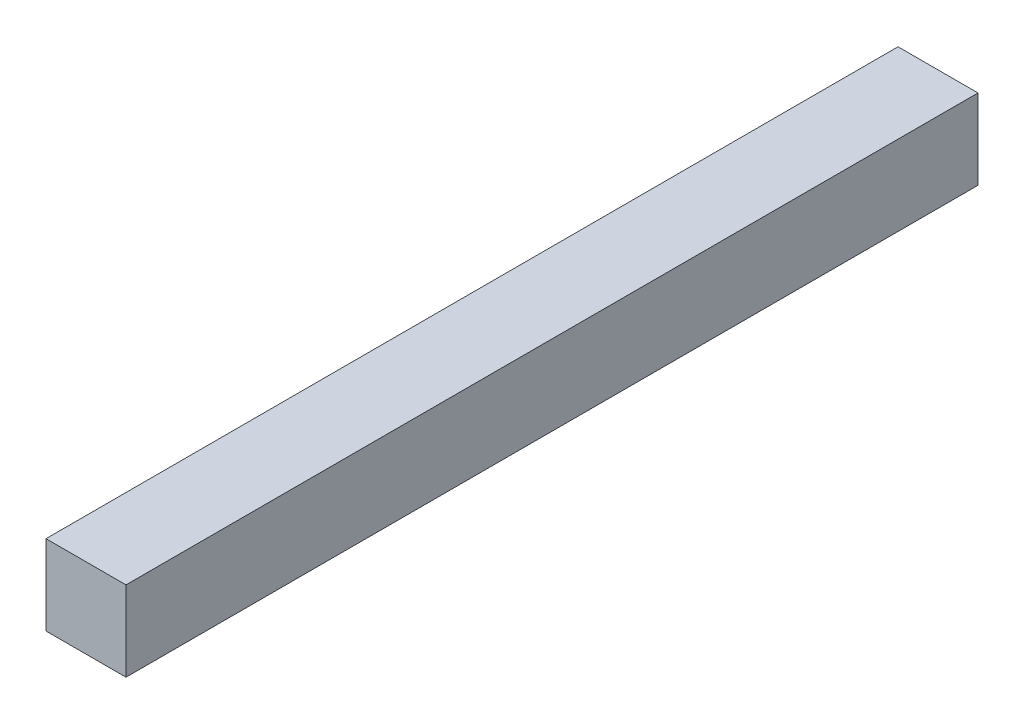
ISO-10303-21;
HEADER;
FILE_DESCRIPTION(('STEP AP214'),'2;1');
FILE_NAME('part.step','',(''),(''),'','','');
FILE_SCHEMA(('AUTOMOTIVE_DESIGN { 1 0 10303 214 1 1 1 1 }'));
ENDSEC;
DATA;
#1=APPLICATION_CONTEXT('core data for automotive mechanical design processes');
#2=APPLICATION_PROTOCOL_DEFINITION('international standard','automotive_design',2000,#1);
#3=PRODUCT_CONTEXT('',#1,'mechanical');
#4=PRODUCT('Part','Part','',(#3));
#5=PRODUCT_RELATED_PRODUCT_CATEGORY('part','',(#4));
#6=PRODUCT_DEFINITION_FORMATION('','',#4);
#7=PRODUCT_DEFINITION_CONTEXT('part definition',#1,'design');
#8=PRODUCT_DEFINITION('design','',#6,#7);
#9=PRODUCT_DEFINITION_SHAPE('','',#8);
#10=(LENGTH_UNIT() NAMED_UNIT(*) SI_UNIT(.MILLI.,.METRE.));
#11=(NAMED_UNIT(*) PLANE_ANGLE_UNIT() SI_UNIT($,.RADIAN.));
#12=(NAMED_UNIT(*) SI_UNIT($,.STERADIAN.) SOLID_ANGLE_UNIT());
#13=UNCERTAINTY_MEASURE_WITH_UNIT(LENGTH_MEASURE(1.E-05),#10,'distance_accuracy_value','');
#14=(GEOMETRIC_REPRESENTATION_CONTEXT(3) GLOBAL_UNCERTAINTY_ASSIGNED_CONTEXT((#13)) GLOBAL_UNIT_ASSIGNED_CONTEXT((#10,
#11,#12)) REPRESENTATION_CONTEXT('',''));
#15=CARTESIAN_POINT('',(0.,0.,0.));
#16=DIRECTION('',(0.,0.,1.));
#17=DIRECTION('',(1.,0.,0.));
#18=AXIS2_PLACEMENT_3D('',#15,#16,#17);
#19=CARTESIAN_POINT('',(0.009999980000003,0.009999980000003,0.));
#20=DIRECTION('',(1.,0.,0.));
#21=DIRECTION('',(0.,0.,-1.));
#22=AXIS2_PLACEMENT_3D('',#19,#20,#21);
#23=PLANE('',#22);
#24=DIRECTION('',(0.,0.,-1.));
#25=VECTOR('',#24,1.);
#26=CARTESIAN_POINT('',(0.009999980000003,0.,0.));
#27=LINE('',#26,#25);
#28=CARTESIAN_POINT('',(0.009999980000003,0.,0.));
#29=VERTEX_POINT('',#28);
#30=CARTESIAN_POINT('',(0.009999980000003,0.,0.10651998));
#31=VERTEX_POINT('',#30);
#32=EDGE_CURVE('E19',#29,#31,#27,.F.);
#33=ORIENTED_EDGE('',*,*,#32,.F.);
#34=DIRECTION('',(0.,1.,0.));
#35=VECTOR('',#34,1.);
#36=CARTESIAN_POINT('',(0.009999980000003,0.,0.));
#37=LINE('',#36,#35);
#38=CARTESIAN_POINT('',(0.009999980000003,0.009999980000003,0.));
#39=VERTEX_POINT('',#38);
#40=EDGE_CURVE('E90',#29,#39,#37,.T.);
#41=ORIENTED_EDGE('',*,*,#40,.T.);
#42=DIRECTION('',(0.,0.,1.));
#43=VECTOR('',#42,1.);
#44=CARTESIAN_POINT('',(0.009999980000003,0.009999980000003,0.));
#45=LINE('',#44,#43);
#46=CARTESIAN_POINT('',(0.009999980000003,0.009999980000003,0.10651998));
#47=VERTEX_POINT('',#46);
#48=EDGE_CURVE('E69',#47,#39,#45,.F.);
#49=ORIENTED_EDGE('',*,*,#48,.F.);
#50=DIRECTION('',(0.,1.,0.));
#51=VECTOR('',#50,1.);
#52=CARTESIAN_POINT('',(0.009999980000003,0.,0.10651998));
#53=LINE('',#52,#51);
#54=EDGE_CURVE('E56',#31,#47,#53,.T.);
#55=ORIENTED_EDGE('',*,*,#54,.F.);
#56=EDGE_LOOP('',(#33,#41,#49,#55));
#57=FACE_BOUND('',#56,.T.);
#58=ADVANCED_FACE('F16',(#57),#23,.T.);
#59=CARTESIAN_POINT('',(0.009999980000003,0.,0.));
#60=DIRECTION('',(0.,-1.,0.));
#61=DIRECTION('',(0.,0.,-1.));
#62=AXIS2_PLACEMENT_3D('',#59,#60,#61);
#63=PLANE('',#62);
#64=DIRECTION('',(0.,0.,1.));
#65=VECTOR('',#64,1.);
#66=CARTESIAN_POINT('',(0.,0.,0.));
#67=LINE('',#66,#65);
#68=CARTESIAN_POINT('',(0.,0.,0.));
#69=VERTEX_POINT('',#68);
#70=CARTESIAN_POINT('',(0.,0.,0.10651998));
#71=VERTEX_POINT('',#70);
#72=EDGE_CURVE('E94',#69,#71,#67,.T.);
#73=ORIENTED_EDGE('',*,*,#72,.F.);
#74=DIRECTION('',(1.,0.,0.));
#75=VECTOR('',#74,1.);
#76=CARTESIAN_POINT('',(0.,0.,0.));
#77=LINE('',#76,#75);
#78=EDGE_CURVE('E65',#69,#29,#77,.T.);
#79=ORIENTED_EDGE('',*,*,#78,.T.);
#80=ORIENTED_EDGE('',*,*,#32,.T.);
#81=DIRECTION('',(1.,0.,0.));
#82=VECTOR('',#81,1.);
#83=CARTESIAN_POINT('',(0.,0.,0.10651998));
#84=LINE('',#83,#82);
#85=EDGE_CURVE('E62',#71,#31,#84,.T.);
#86=ORIENTED_EDGE('',*,*,#85,.F.);
#87=EDGE_LOOP('',(#73,#79,#80,#86));
#88=FACE_BOUND('',#87,.T.);
#89=ADVANCED_FACE('F61',(#88),#63,.T.);
#90=CARTESIAN_POINT('',(0.,0.,0.10651998));
#91=DIRECTION('',(0.,0.,1.));
#92=DIRECTION('',(1.,0.,0.));
#93=AXIS2_PLACEMENT_3D('',#90,#91,#92);
#94=PLANE('',#93);
#95=DIRECTION('',(1.,0.,0.));
#96=VECTOR('',#95,1.);
#97=CARTESIAN_POINT('',(0.,0.009999980000003,0.10651998));
#98=LINE('',#97,#96);
#99=CARTESIAN_POINT('',(0.,0.009999980000003,0.10651998));
#100=VERTEX_POINT('',#99);
#101=EDGE_CURVE('E72',#100,#47,#98,.T.);
#102=ORIENTED_EDGE('',*,*,#101,.F.);
#103=DIRECTION('',(0.,1.,0.));
#104=VECTOR('',#103,1.);
#105=CARTESIAN_POINT('',(0.,0.,0.10651998));
#106=LINE('',#105,#104);
#107=EDGE_CURVE('E76',#71,#100,#106,.T.);
#108=ORIENTED_EDGE('',*,*,#107,.F.);
#109=ORIENTED_EDGE('',*,*,#85,.T.);
#110=ORIENTED_EDGE('',*,*,#54,.T.);
#111=EDGE_LOOP('',(#102,#108,#109,#110));
#112=FACE_BOUND('',#111,.T.);
#113=ADVANCED_FACE('F74',(#112),#94,.T.);
#114=CARTESIAN_POINT('',(0.,0.009999980000003,0.));
#115=DIRECTION('',(0.,1.,0.));
#116=DIRECTION('',(0.,0.,1.));
#117=AXIS2_PLACEMENT_3D('',#114,#115,#116);
#118=PLANE('',#117);
#119=ORIENTED_EDGE('',*,*,#48,.T.);
#120=DIRECTION('',(1.,0.,0.));
#121=VECTOR('',#120,1.);
#122=CARTESIAN_POINT('',(0.,0.009999980000003,0.));
#123=LINE('',#122,#121);
#124=CARTESIAN_POINT('',(0.,0.009999980000003,0.));
#125=VERTEX_POINT('',#124);
#126=EDGE_CURVE('E35',#39,#125,#123,.F.);
#127=ORIENTED_EDGE('',*,*,#126,.T.);
#128=DIRECTION('',(0.,0.,1.));
#129=VECTOR('',#128,1.);
#130=CARTESIAN_POINT('',(0.,0.009999980000003,0.));
#131=LINE('',#130,#129);
#132=EDGE_CURVE('E26',#100,#125,#131,.F.);
#133=ORIENTED_EDGE('',*,*,#132,.F.);
#134=ORIENTED_EDGE('',*,*,#101,.T.);
#135=EDGE_LOOP('',(#119,#127,#133,#134));
#136=FACE_BOUND('',#135,.T.);
#137=ADVANCED_FACE('F103',(#136),#118,.T.);
#138=CARTESIAN_POINT('',(0.,0.,0.));
#139=DIRECTION('',(0.,0.,1.));
#140=DIRECTION('',(1.,0.,0.));
#141=AXIS2_PLACEMENT_3D('',#138,#139,#140);
#142=PLANE('',#141);
#143=ORIENTED_EDGE('',*,*,#126,.F.);
#144=ORIENTED_EDGE('',*,*,#40,.F.);
#145=ORIENTED_EDGE('',*,*,#78,.F.);
#146=DIRECTION('',(0.,1.,0.));
#147=VECTOR('',#146,1.);
#148=CARTESIAN_POINT('',(0.,0.,0.));
#149=LINE('',#148,#147);
#150=EDGE_CURVE('E11',#125,#69,#149,.F.);
#151=ORIENTED_EDGE('',*,*,#150,.F.);
#152=EDGE_LOOP('',(#143,#144,#145,#151));
#153=FACE_BOUND('',#152,.T.);
#154=ADVANCED_FACE('F105',(#153),#142,.F.);
#155=CARTESIAN_POINT('',(0.,0.,0.));
#156=DIRECTION('',(-1.,0.,0.));
#157=DIRECTION('',(0.,0.,1.));
#158=AXIS2_PLACEMENT_3D('',#155,#156,#157);
#159=PLANE('',#158);
#160=ORIENTED_EDGE('',*,*,#132,.T.);
#161=ORIENTED_EDGE('',*,*,#150,.T.);
#162=ORIENTED_EDGE('',*,*,#72,.T.);
#163=ORIENTED_EDGE('',*,*,#107,.T.);
#164=EDGE_LOOP('',(#160,#161,#162,#163));
#165=FACE_BOUND('',#164,.T.);
#166=ADVANCED_FACE('F102',(#165),#159,.T.);
#167=CLOSED_SHELL('',(#58,#89,#113,#137,#154,#166));
#168=MANIFOLD_SOLID_BREP('B1',#167);
#169=ADVANCED_BREP_SHAPE_REPRESENTATION('',(#18,#168),#14);
#170=SHAPE_DEFINITION_REPRESENTATION(#9,#169);
ENDSEC;
END-ISO-10303-21;
